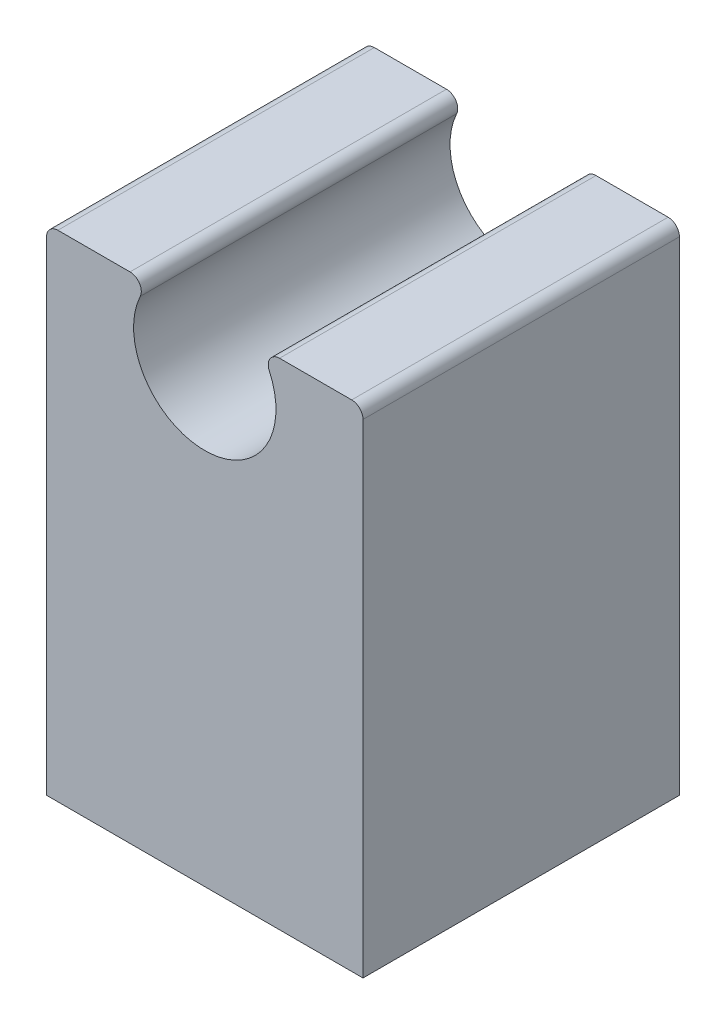
ISO-10303-21;
HEADER;
FILE_DESCRIPTION(('STEP AP214'),'2;1');
FILE_NAME('part.step','',(''),(''),'','','');
FILE_SCHEMA(('AUTOMOTIVE_DESIGN { 1 0 10303 214 1 1 1 1 }'));
ENDSEC;
DATA;
#1=APPLICATION_CONTEXT('core data for automotive mechanical design processes');
#2=APPLICATION_PROTOCOL_DEFINITION('international standard','automotive_design',2000,#1);
#3=PRODUCT_CONTEXT('',#1,'mechanical');
#4=PRODUCT('Part','Part','',(#3));
#5=PRODUCT_RELATED_PRODUCT_CATEGORY('part','',(#4));
#6=PRODUCT_DEFINITION_FORMATION('','',#4);
#7=PRODUCT_DEFINITION_CONTEXT('part definition',#1,'design');
#8=PRODUCT_DEFINITION('design','',#6,#7);
#9=PRODUCT_DEFINITION_SHAPE('','',#8);
#10=(LENGTH_UNIT() NAMED_UNIT(*) SI_UNIT(.MILLI.,.METRE.));
#11=(NAMED_UNIT(*) PLANE_ANGLE_UNIT() SI_UNIT($,.RADIAN.));
#12=(NAMED_UNIT(*) SI_UNIT($,.STERADIAN.) SOLID_ANGLE_UNIT());
#13=UNCERTAINTY_MEASURE_WITH_UNIT(LENGTH_MEASURE(1.E-05),#10,'distance_accuracy_value','');
#14=(GEOMETRIC_REPRESENTATION_CONTEXT(3) GLOBAL_UNCERTAINTY_ASSIGNED_CONTEXT((#13)) GLOBAL_UNIT_ASSIGNED_CONTEXT((#10,
#11,#12)) REPRESENTATION_CONTEXT('',''));
#15=CARTESIAN_POINT('',(0.,0.,0.));
#16=DIRECTION('',(0.,0.,1.));
#17=DIRECTION('',(1.,0.,0.));
#18=AXIS2_PLACEMENT_3D('',#15,#16,#17);
#19=CARTESIAN_POINT('',(-5.2509207411436,2.44854455396016,11.1125));
#20=DIRECTION('',(0.,0.,-1.));
#21=DIRECTION('',(-1.,0.,0.));
#22=AXIS2_PLACEMENT_3D('',#19,#20,#21);
#23=CYLINDRICAL_SURFACE('',#22,0.79375);
#24=CARTESIAN_POINT('',(-5.2509207411436,2.44854455396016,-11.1125));
#25=DIRECTION('',(0.,0.,1.));
#26=DIRECTION('',(1.,0.,0.));
#27=AXIS2_PLACEMENT_3D('',#24,#25,#26);
#28=CIRCLE('',#27,0.79375);
#29=CARTESIAN_POINT('',(-4.53153893518326,2.11309130870349,-11.1125));
#30=VERTEX_POINT('',#29);
#31=CARTESIAN_POINT('',(-5.2509207411436,3.24229455396016,-11.1125));
#32=VERTEX_POINT('',#31);
#33=EDGE_CURVE('E176',#30,#32,#28,.T.);
#34=ORIENTED_EDGE('',*,*,#33,.T.);
#35=DIRECTION('',(0.,0.,-1.));
#36=VECTOR('',#35,1.);
#37=CARTESIAN_POINT('',(-5.2509207411436,3.24229455396016,11.1125));
#38=LINE('',#37,#36);
#39=CARTESIAN_POINT('',(-5.2509207411436,3.24229455396016,11.1125));
#40=VERTEX_POINT('',#39);
#41=EDGE_CURVE('E11',#40,#32,#38,.T.);
#42=ORIENTED_EDGE('',*,*,#41,.F.);
#43=CARTESIAN_POINT('',(-5.2509207411436,2.44854455396016,11.1125));
#44=DIRECTION('',(0.,0.,1.));
#45=DIRECTION('',(1.,0.,0.));
#46=AXIS2_PLACEMENT_3D('',#43,#44,#45);
#47=CIRCLE('',#46,0.79375);
#48=CARTESIAN_POINT('',(-4.53153893518326,2.11309130870349,11.1125));
#49=VERTEX_POINT('',#48);
#50=EDGE_CURVE('E177',#49,#40,#47,.T.);
#51=ORIENTED_EDGE('',*,*,#50,.F.);
#52=DIRECTION('',(0.,0.,-1.));
#53=VECTOR('',#52,1.);
#54=CARTESIAN_POINT('',(-4.53153893518326,2.11309130870349,11.1125));
#55=LINE('',#54,#53);
#56=EDGE_CURVE('E185',#49,#30,#55,.T.);
#57=ORIENTED_EDGE('',*,*,#56,.T.);
#58=EDGE_LOOP('',(#34,#42,#51,#57));
#59=FACE_BOUND('',#58,.T.);
#60=ADVANCED_FACE('F33',(#59),#23,.T.);
#61=CARTESIAN_POINT('',(-10.31875,3.24229455396017,11.1125));
#62=DIRECTION('',(0.,-1.,0.));
#63=DIRECTION('',(1.,0.,0.));
#64=AXIS2_PLACEMENT_3D('',#61,#62,#63);
#65=PLANE('',#64);
#66=DIRECTION('',(-1.,0.,0.));
#67=VECTOR('',#66,1.);
#68=CARTESIAN_POINT('',(-10.31875,3.24229455396017,-11.1125));
#69=LINE('',#68,#67);
#70=CARTESIAN_POINT('',(-10.31875,3.24229455396017,-11.1125));
#71=VERTEX_POINT('',#70);
#72=EDGE_CURVE('E188',#32,#71,#69,.T.);
#73=ORIENTED_EDGE('',*,*,#72,.T.);
#74=DIRECTION('',(0.,0.,-1.));
#75=VECTOR('',#74,1.);
#76=CARTESIAN_POINT('',(-10.31875,3.24229455396017,11.1125));
#77=LINE('',#76,#75);
#78=CARTESIAN_POINT('',(-10.31875,3.24229455396017,11.1125));
#79=VERTEX_POINT('',#78);
#80=EDGE_CURVE('E41',#79,#71,#77,.T.);
#81=ORIENTED_EDGE('',*,*,#80,.F.);
#82=DIRECTION('',(-1.,0.,0.));
#83=VECTOR('',#82,1.);
#84=CARTESIAN_POINT('',(-10.31875,3.24229455396017,11.1125));
#85=LINE('',#84,#83);
#86=EDGE_CURVE('E82',#40,#79,#85,.T.);
#87=ORIENTED_EDGE('',*,*,#86,.F.);
#88=ORIENTED_EDGE('',*,*,#41,.T.);
#89=EDGE_LOOP('',(#73,#81,#87,#88));
#90=FACE_BOUND('',#89,.T.);
#91=ADVANCED_FACE('F196',(#90),#65,.F.);
#92=CARTESIAN_POINT('',(-10.31875,2.44854455396017,11.1125));
#93=DIRECTION('',(0.,0.,-1.));
#94=DIRECTION('',(-1.,0.,0.));
#95=AXIS2_PLACEMENT_3D('',#92,#93,#94);
#96=CYLINDRICAL_SURFACE('',#95,0.79375);
#97=CARTESIAN_POINT('',(-10.31875,2.44854455396017,-11.1125));
#98=DIRECTION('',(0.,0.,1.));
#99=DIRECTION('',(1.,0.,0.));
#100=AXIS2_PLACEMENT_3D('',#97,#98,#99);
#101=CIRCLE('',#100,0.79375);
#102=CARTESIAN_POINT('',(-11.1125,2.44854455396017,-11.1125));
#103=VERTEX_POINT('',#102);
#104=EDGE_CURVE('E68',#71,#103,#101,.T.);
#105=ORIENTED_EDGE('',*,*,#104,.T.);
#106=DIRECTION('',(0.,0.,-1.));
#107=VECTOR('',#106,1.);
#108=CARTESIAN_POINT('',(-11.1125,2.44854455396017,11.1125));
#109=LINE('',#108,#107);
#110=CARTESIAN_POINT('',(-11.1125,2.44854455396017,11.1125));
#111=VERTEX_POINT('',#110);
#112=EDGE_CURVE('E125',#111,#103,#109,.T.);
#113=ORIENTED_EDGE('',*,*,#112,.F.);
#114=CARTESIAN_POINT('',(-10.31875,2.44854455396017,11.1125));
#115=DIRECTION('',(0.,0.,1.));
#116=DIRECTION('',(1.,0.,0.));
#117=AXIS2_PLACEMENT_3D('',#114,#115,#116);
#118=CIRCLE('',#117,0.79375);
#119=EDGE_CURVE('E180',#79,#111,#118,.T.);
#120=ORIENTED_EDGE('',*,*,#119,.F.);
#121=ORIENTED_EDGE('',*,*,#80,.T.);
#122=EDGE_LOOP('',(#105,#113,#120,#121));
#123=FACE_BOUND('',#122,.T.);
#124=ADVANCED_FACE('F194',(#123),#96,.T.);
#125=CARTESIAN_POINT('',(-11.1125,2.44854455396017,11.1125));
#126=DIRECTION('',(1.,0.,0.));
#127=DIRECTION('',(0.,1.,0.));
#128=AXIS2_PLACEMENT_3D('',#125,#126,#127);
#129=PLANE('',#128);
#130=DIRECTION('',(0.,-1.,0.));
#131=VECTOR('',#130,1.);
#132=CARTESIAN_POINT('',(-11.1125,2.44854455396017,-11.1125));
#133=LINE('',#132,#131);
#134=CARTESIAN_POINT('',(-11.1125,-31.524,-11.1125));
#135=VERTEX_POINT('',#134);
#136=EDGE_CURVE('E119',#103,#135,#133,.T.);
#137=ORIENTED_EDGE('',*,*,#136,.T.);
#138=DIRECTION('',(0.,0.,-1.));
#139=VECTOR('',#138,1.);
#140=CARTESIAN_POINT('',(-11.1125,-31.524,11.1125));
#141=LINE('',#140,#139);
#142=CARTESIAN_POINT('',(-11.1125,-31.524,11.1125));
#143=VERTEX_POINT('',#142);
#144=EDGE_CURVE('E124',#143,#135,#141,.T.);
#145=ORIENTED_EDGE('',*,*,#144,.F.);
#146=DIRECTION('',(0.,-1.,0.));
#147=VECTOR('',#146,1.);
#148=CARTESIAN_POINT('',(-11.1125,2.44854455396017,11.1125));
#149=LINE('',#148,#147);
#150=EDGE_CURVE('E182',#111,#143,#149,.T.);
#151=ORIENTED_EDGE('',*,*,#150,.F.);
#152=ORIENTED_EDGE('',*,*,#112,.T.);
#153=EDGE_LOOP('',(#137,#145,#151,#152));
#154=FACE_BOUND('',#153,.T.);
#155=ADVANCED_FACE('F121',(#154),#129,.F.);
#156=CARTESIAN_POINT('',(0.,0.,11.1125));
#157=DIRECTION('',(0.,0.,-1.));
#158=DIRECTION('',(-1.,0.,0.));
#159=AXIS2_PLACEMENT_3D('',#156,#157,#158);
#160=CYLINDRICAL_SURFACE('',#159,5.);
#161=CARTESIAN_POINT('',(0.,0.,-11.1125));
#162=DIRECTION('',(0.,0.,-1.));
#163=DIRECTION('',(1.,0.,0.));
#164=AXIS2_PLACEMENT_3D('',#161,#162,#163);
#165=CIRCLE('',#164,5.);
#166=CARTESIAN_POINT('',(4.53153893518326,2.11309130870349,-11.1125));
#167=VERTEX_POINT('',#166);
#168=EDGE_CURVE('E75',#167,#30,#165,.T.);
#169=ORIENTED_EDGE('',*,*,#168,.T.);
#170=ORIENTED_EDGE('',*,*,#56,.F.);
#171=CARTESIAN_POINT('',(0.,0.,11.1125));
#172=DIRECTION('',(0.,0.,-1.));
#173=DIRECTION('',(1.,0.,0.));
#174=AXIS2_PLACEMENT_3D('',#171,#172,#173);
#175=CIRCLE('',#174,5.);
#176=CARTESIAN_POINT('',(4.53153893518326,2.11309130870349,11.1125));
#177=VERTEX_POINT('',#176);
#178=EDGE_CURVE('E49',#177,#49,#175,.T.);
#179=ORIENTED_EDGE('',*,*,#178,.F.);
#180=DIRECTION('',(0.,0.,-1.));
#181=VECTOR('',#180,1.);
#182=CARTESIAN_POINT('',(4.53153893518326,2.11309130870349,11.1125));
#183=LINE('',#182,#181);
#184=EDGE_CURVE('E174',#177,#167,#183,.T.);
#185=ORIENTED_EDGE('',*,*,#184,.T.);
#186=EDGE_LOOP('',(#169,#170,#179,#185));
#187=FACE_BOUND('',#186,.T.);
#188=ADVANCED_FACE('F199',(#187),#160,.F.);
#189=CARTESIAN_POINT('',(-5.2509207411436,2.44854455396016,11.1125));
#190=DIRECTION('',(0.,0.,1.));
#191=DIRECTION('',(1.,0.,0.));
#192=AXIS2_PLACEMENT_3D('',#189,#190,#191);
#193=PLANE('',#192);
#194=ORIENTED_EDGE('',*,*,#50,.T.);
#195=ORIENTED_EDGE('',*,*,#86,.T.);
#196=ORIENTED_EDGE('',*,*,#119,.T.);
#197=ORIENTED_EDGE('',*,*,#150,.T.);
#198=DIRECTION('',(-1.,0.,0.));
#199=VECTOR('',#198,1.);
#200=CARTESIAN_POINT('',(11.1125,-31.524,11.1125));
#201=LINE('',#200,#199);
#202=CARTESIAN_POINT('',(11.1125,-31.524,11.1125));
#203=VERTEX_POINT('',#202);
#204=EDGE_CURVE('E143',#203,#143,#201,.T.);
#205=ORIENTED_EDGE('',*,*,#204,.F.);
#206=DIRECTION('',(0.,-1.,0.));
#207=VECTOR('',#206,1.);
#208=CARTESIAN_POINT('',(11.1125,2.44854455396017,11.1125));
#209=LINE('',#208,#207);
#210=CARTESIAN_POINT('',(11.1125,2.44854455396017,11.1125));
#211=VERTEX_POINT('',#210);
#212=EDGE_CURVE('E152',#211,#203,#209,.T.);
#213=ORIENTED_EDGE('',*,*,#212,.F.);
#214=CARTESIAN_POINT('',(10.31875,2.44854455396017,11.1125));
#215=DIRECTION('',(0.,0.,-1.));
#216=DIRECTION('',(-1.,0.,0.));
#217=AXIS2_PLACEMENT_3D('',#214,#215,#216);
#218=CIRCLE('',#217,0.79375);
#219=CARTESIAN_POINT('',(10.31875,3.24229455396017,11.1125));
#220=VERTEX_POINT('',#219);
#221=EDGE_CURVE('E155',#220,#211,#218,.T.);
#222=ORIENTED_EDGE('',*,*,#221,.F.);
#223=DIRECTION('',(1.,0.,0.));
#224=VECTOR('',#223,1.);
#225=CARTESIAN_POINT('',(10.31875,3.24229455396017,11.1125));
#226=LINE('',#225,#224);
#227=CARTESIAN_POINT('',(5.2509207411436,3.24229455396016,11.1125));
#228=VERTEX_POINT('',#227);
#229=EDGE_CURVE('E158',#228,#220,#226,.T.);
#230=ORIENTED_EDGE('',*,*,#229,.F.);
#231=CARTESIAN_POINT('',(5.2509207411436,2.44854455396016,11.1125));
#232=DIRECTION('',(0.,0.,-1.));
#233=DIRECTION('',(-1.,0.,0.));
#234=AXIS2_PLACEMENT_3D('',#231,#232,#233);
#235=CIRCLE('',#234,0.79375);
#236=EDGE_CURVE('E149',#177,#228,#235,.T.);
#237=ORIENTED_EDGE('',*,*,#236,.F.);
#238=ORIENTED_EDGE('',*,*,#178,.T.);
#239=EDGE_LOOP('',(#194,#195,#196,#197,#205,#213,#222,#230,#237,#238));
#240=FACE_BOUND('',#239,.T.);
#241=ADVANCED_FACE('F205',(#240),#193,.T.);
#242=CARTESIAN_POINT('',(-5.2509207411436,2.44854455396016,-11.1125));
#243=DIRECTION('',(0.,0.,1.));
#244=DIRECTION('',(1.,0.,0.));
#245=AXIS2_PLACEMENT_3D('',#242,#243,#244);
#246=PLANE('',#245);
#247=ORIENTED_EDGE('',*,*,#33,.F.);
#248=ORIENTED_EDGE('',*,*,#168,.F.);
#249=CARTESIAN_POINT('',(5.2509207411436,2.44854455396016,-11.1125));
#250=DIRECTION('',(0.,0.,-1.));
#251=DIRECTION('',(-1.,0.,0.));
#252=AXIS2_PLACEMENT_3D('',#249,#250,#251);
#253=CIRCLE('',#252,0.79375);
#254=CARTESIAN_POINT('',(5.2509207411436,3.24229455396016,-11.1125));
#255=VERTEX_POINT('',#254);
#256=EDGE_CURVE('E148',#167,#255,#253,.T.);
#257=ORIENTED_EDGE('',*,*,#256,.T.);
#258=DIRECTION('',(1.,0.,0.));
#259=VECTOR('',#258,1.);
#260=CARTESIAN_POINT('',(10.31875,3.24229455396017,-11.1125));
#261=LINE('',#260,#259);
#262=CARTESIAN_POINT('',(10.31875,3.24229455396017,-11.1125));
#263=VERTEX_POINT('',#262);
#264=EDGE_CURVE('E153',#255,#263,#261,.T.);
#265=ORIENTED_EDGE('',*,*,#264,.T.);
#266=CARTESIAN_POINT('',(10.31875,2.44854455396017,-11.1125));
#267=DIRECTION('',(0.,0.,-1.));
#268=DIRECTION('',(-1.,0.,0.));
#269=AXIS2_PLACEMENT_3D('',#266,#267,#268);
#270=CIRCLE('',#269,0.79375);
#271=CARTESIAN_POINT('',(11.1125,2.44854455396017,-11.1125));
#272=VERTEX_POINT('',#271);
#273=EDGE_CURVE('E165',#263,#272,#270,.T.);
#274=ORIENTED_EDGE('',*,*,#273,.T.);
#275=DIRECTION('',(0.,-1.,0.));
#276=VECTOR('',#275,1.);
#277=CARTESIAN_POINT('',(11.1125,2.44854455396017,-11.1125));
#278=LINE('',#277,#276);
#279=CARTESIAN_POINT('',(11.1125,-31.524,-11.1125));
#280=VERTEX_POINT('',#279);
#281=EDGE_CURVE('E134',#272,#280,#278,.T.);
#282=ORIENTED_EDGE('',*,*,#281,.T.);
#283=DIRECTION('',(1.,0.,0.));
#284=VECTOR('',#283,1.);
#285=CARTESIAN_POINT('',(-11.1125,-31.524,-11.1125));
#286=LINE('',#285,#284);
#287=EDGE_CURVE('E129',#135,#280,#286,.T.);
#288=ORIENTED_EDGE('',*,*,#287,.F.);
#289=ORIENTED_EDGE('',*,*,#136,.F.);
#290=ORIENTED_EDGE('',*,*,#104,.F.);
#291=ORIENTED_EDGE('',*,*,#72,.F.);
#292=EDGE_LOOP('',(#247,#248,#257,#265,#274,#282,#288,#289,#290,#291));
#293=FACE_BOUND('',#292,.T.);
#294=ADVANCED_FACE('F131',(#293),#246,.F.);
#295=CARTESIAN_POINT('',(5.2509207411436,2.44854455396016,11.1125));
#296=DIRECTION('',(0.,0.,-1.));
#297=DIRECTION('',(-1.,0.,0.));
#298=AXIS2_PLACEMENT_3D('',#295,#296,#297);
#299=CYLINDRICAL_SURFACE('',#298,0.79375);
#300=ORIENTED_EDGE('',*,*,#256,.F.);
#301=ORIENTED_EDGE('',*,*,#184,.F.);
#302=ORIENTED_EDGE('',*,*,#236,.T.);
#303=DIRECTION('',(0.,0.,-1.));
#304=VECTOR('',#303,1.);
#305=CARTESIAN_POINT('',(5.2509207411436,3.24229455396016,11.1125));
#306=LINE('',#305,#304);
#307=EDGE_CURVE('E161',#228,#255,#306,.T.);
#308=ORIENTED_EDGE('',*,*,#307,.T.);
#309=EDGE_LOOP('',(#300,#301,#302,#308));
#310=FACE_BOUND('',#309,.T.);
#311=ADVANCED_FACE('F203',(#310),#299,.T.);
#312=CARTESIAN_POINT('',(11.1125,2.44854455396017,11.1125));
#313=DIRECTION('',(1.,0.,0.));
#314=DIRECTION('',(0.,1.,0.));
#315=AXIS2_PLACEMENT_3D('',#312,#313,#314);
#316=PLANE('',#315);
#317=ORIENTED_EDGE('',*,*,#281,.F.);
#318=DIRECTION('',(0.,0.,-1.));
#319=VECTOR('',#318,1.);
#320=CARTESIAN_POINT('',(11.1125,2.44854455396017,11.1125));
#321=LINE('',#320,#319);
#322=EDGE_CURVE('E172',#211,#272,#321,.T.);
#323=ORIENTED_EDGE('',*,*,#322,.F.);
#324=ORIENTED_EDGE('',*,*,#212,.T.);
#325=DIRECTION('',(0.,0.,1.));
#326=VECTOR('',#325,1.);
#327=CARTESIAN_POINT('',(11.1125,-31.524,-11.1125));
#328=LINE('',#327,#326);
#329=EDGE_CURVE('E138',#280,#203,#328,.T.);
#330=ORIENTED_EDGE('',*,*,#329,.F.);
#331=EDGE_LOOP('',(#317,#323,#324,#330));
#332=FACE_BOUND('',#331,.T.);
#333=ADVANCED_FACE('F215',(#332),#316,.T.);
#334=CARTESIAN_POINT('',(10.31875,2.44854455396017,11.1125));
#335=DIRECTION('',(0.,0.,-1.));
#336=DIRECTION('',(-1.,0.,0.));
#337=AXIS2_PLACEMENT_3D('',#334,#335,#336);
#338=CYLINDRICAL_SURFACE('',#337,0.79375);
#339=ORIENTED_EDGE('',*,*,#273,.F.);
#340=DIRECTION('',(0.,0.,-1.));
#341=VECTOR('',#340,1.);
#342=CARTESIAN_POINT('',(10.31875,3.24229455396017,11.1125));
#343=LINE('',#342,#341);
#344=EDGE_CURVE('E170',#220,#263,#343,.T.);
#345=ORIENTED_EDGE('',*,*,#344,.F.);
#346=ORIENTED_EDGE('',*,*,#221,.T.);
#347=ORIENTED_EDGE('',*,*,#322,.T.);
#348=EDGE_LOOP('',(#339,#345,#346,#347));
#349=FACE_BOUND('',#348,.T.);
#350=ADVANCED_FACE('F213',(#349),#338,.T.);
#351=CARTESIAN_POINT('',(10.31875,3.24229455396017,11.1125));
#352=DIRECTION('',(0.,1.,0.));
#353=DIRECTION('',(-1.,0.,0.));
#354=AXIS2_PLACEMENT_3D('',#351,#352,#353);
#355=PLANE('',#354);
#356=ORIENTED_EDGE('',*,*,#264,.F.);
#357=ORIENTED_EDGE('',*,*,#307,.F.);
#358=ORIENTED_EDGE('',*,*,#229,.T.);
#359=ORIENTED_EDGE('',*,*,#344,.T.);
#360=EDGE_LOOP('',(#356,#357,#358,#359));
#361=FACE_BOUND('',#360,.T.);
#362=ADVANCED_FACE('F210',(#361),#355,.T.);
#363=CARTESIAN_POINT('',(0.,-31.524,0.));
#364=DIRECTION('',(0.,-1.,0.));
#365=DIRECTION('',(0.,0.,-1.));
#366=AXIS2_PLACEMENT_3D('',#363,#364,#365);
#367=PLANE('',#366);
#368=ORIENTED_EDGE('',*,*,#144,.T.);
#369=ORIENTED_EDGE('',*,*,#287,.T.);
#370=ORIENTED_EDGE('',*,*,#329,.T.);
#371=ORIENTED_EDGE('',*,*,#204,.T.);
#372=EDGE_LOOP('',(#368,#369,#370,#371));
#373=FACE_BOUND('',#372,.T.);
#374=ADVANCED_FACE('F141',(#373),#367,.T.);
#375=CLOSED_SHELL('',(#60,#91,#124,#155,#188,#241,#294,#311,#333,#350,#362,#374));
#376=MANIFOLD_SOLID_BREP('B2',#375);
#377=ADVANCED_BREP_SHAPE_REPRESENTATION('',(#18,#376),#14);
#378=SHAPE_DEFINITION_REPRESENTATION(#9,#377);
ENDSEC;
END-ISO-10303-21;
